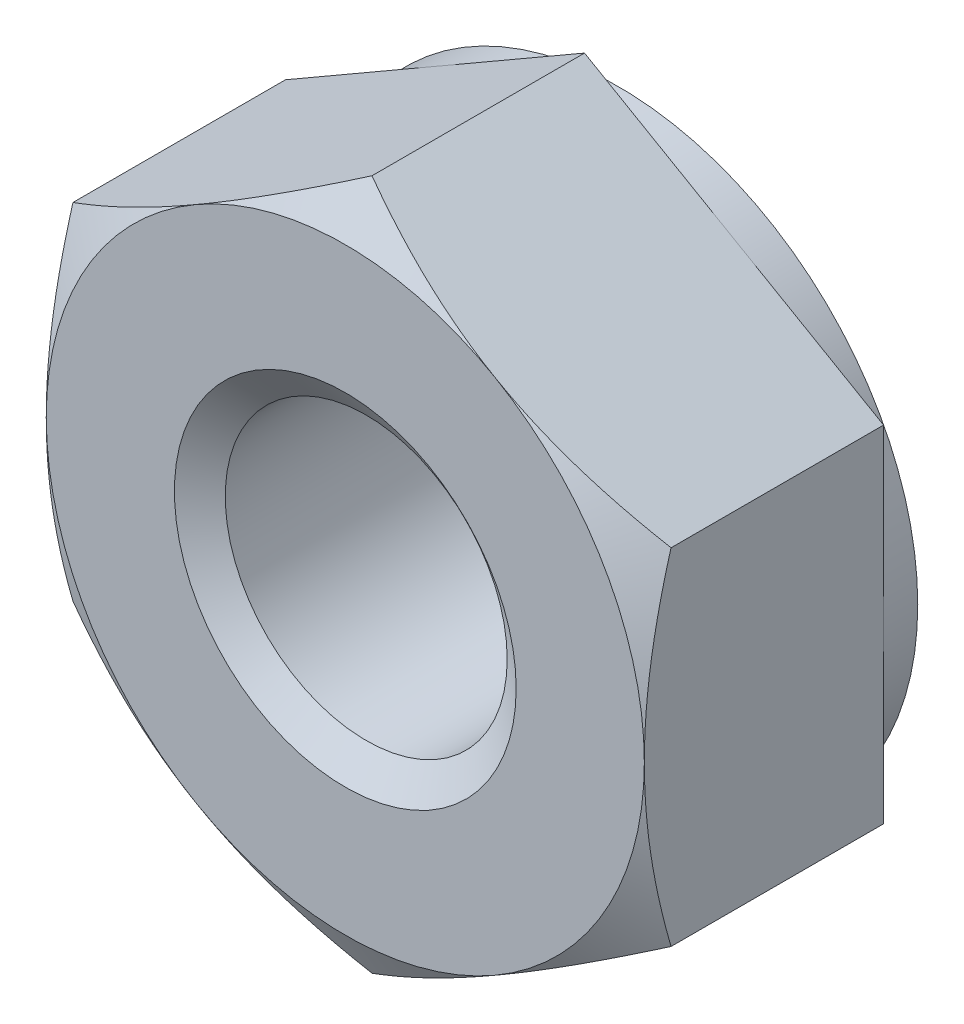
ISO-10303-21;
HEADER;
FILE_DESCRIPTION(('STEP AP214'),'2;1');
FILE_NAME('part.step','',(''),(''),'','','');
FILE_SCHEMA(('AUTOMOTIVE_DESIGN { 1 0 10303 214 1 1 1 1 }'));
ENDSEC;
DATA;
#1=APPLICATION_CONTEXT('core data for automotive mechanical design processes');
#2=APPLICATION_PROTOCOL_DEFINITION('international standard','automotive_design',2000,#1);
#3=PRODUCT_CONTEXT('',#1,'mechanical');
#4=PRODUCT('Part','Part','',(#3));
#5=PRODUCT_RELATED_PRODUCT_CATEGORY('part','',(#4));
#6=PRODUCT_DEFINITION_FORMATION('','',#4);
#7=PRODUCT_DEFINITION_CONTEXT('part definition',#1,'design');
#8=PRODUCT_DEFINITION('design','',#6,#7);
#9=PRODUCT_DEFINITION_SHAPE('','',#8);
#10=(LENGTH_UNIT() NAMED_UNIT(*) SI_UNIT(.MILLI.,.METRE.));
#11=(NAMED_UNIT(*) PLANE_ANGLE_UNIT() SI_UNIT($,.RADIAN.));
#12=(NAMED_UNIT(*) SI_UNIT($,.STERADIAN.) SOLID_ANGLE_UNIT());
#13=UNCERTAINTY_MEASURE_WITH_UNIT(LENGTH_MEASURE(1.E-05),#10,'distance_accuracy_value','');
#14=(GEOMETRIC_REPRESENTATION_CONTEXT(3) GLOBAL_UNCERTAINTY_ASSIGNED_CONTEXT((#13)) GLOBAL_UNIT_ASSIGNED_CONTEXT((#10,
#11,#12)) REPRESENTATION_CONTEXT('',''));
#15=CARTESIAN_POINT('',(0.,0.,0.));
#16=DIRECTION('',(0.,0.,1.));
#17=DIRECTION('',(1.,0.,0.));
#18=AXIS2_PLACEMENT_3D('',#15,#16,#17);
#19=CARTESIAN_POINT('',(0.,0.,-3.2));
#20=DIRECTION('',(0.,0.,1.));
#21=DIRECTION('',(1.,0.,0.));
#22=AXIS2_PLACEMENT_3D('',#19,#20,#21);
#23=CYLINDRICAL_SURFACE('',#22,1.65);
#24=CARTESIAN_POINT('',(0.,0.,-0.245072638373399));
#25=DIRECTION('',(0.,0.,1.));
#26=DIRECTION('',(1.,0.,0.));
#27=AXIS2_PLACEMENT_3D('',#24,#25,#26);
#28=CIRCLE('',#27,1.65);
#29=CARTESIAN_POINT('',(1.65,0.,-0.245072638373399));
#30=VERTEX_POINT('',#29);
#31=EDGE_CURVE('E154',#30,#30,#28,.F.);
#32=ORIENTED_EDGE('',*,*,#31,.F.);
#33=EDGE_LOOP('',(#32));
#34=FACE_BOUND('',#33,.T.);
#35=CARTESIAN_POINT('',(0.,0.,-2.9295273616266));
#36=DIRECTION('',(0.,0.,-1.));
#37=DIRECTION('',(-1.,0.,0.));
#38=AXIS2_PLACEMENT_3D('',#35,#36,#37);
#39=CIRCLE('',#38,1.65);
#40=CARTESIAN_POINT('',(-1.65,0.,-2.9295273616266));
#41=VERTEX_POINT('',#40);
#42=EDGE_CURVE('E42',#41,#41,#39,.F.);
#43=ORIENTED_EDGE('',*,*,#42,.F.);
#44=EDGE_LOOP('',(#43));
#45=FACE_BOUND('',#44,.T.);
#46=ADVANCED_FACE('F37',(#34,#45),#23,.F.);
#47=CARTESIAN_POINT('',(-6.99999999999999,0.,-3.2));
#48=DIRECTION('',(0.,0.,1.));
#49=DIRECTION('',(1.,0.,0.));
#50=AXIS2_PLACEMENT_3D('',#47,#48,#49);
#51=PLANE('',#50);
#52=CARTESIAN_POINT('',(0.,0.,-3.2));
#53=DIRECTION('',(0.,0.,1.));
#54=DIRECTION('',(1.,0.,0.));
#55=AXIS2_PLACEMENT_3D('',#52,#53,#54);
#56=CIRCLE('',#55,3.5);
#57=CARTESIAN_POINT('',(3.5,0.,-3.2));
#58=VERTEX_POINT('',#57);
#59=EDGE_CURVE('E278',#58,#58,#56,.F.);
#60=ORIENTED_EDGE('',*,*,#59,.T.);
#61=EDGE_LOOP('',(#60));
#62=FACE_BOUND('',#61,.T.);
#63=CARTESIAN_POINT('',(0.,0.,-3.2));
#64=DIRECTION('',(0.,0.,1.));
#65=DIRECTION('',(1.,0.,0.));
#66=AXIS2_PLACEMENT_3D('',#63,#64,#65);
#67=CIRCLE('',#66,2.);
#68=CARTESIAN_POINT('',(2.,0.,-3.2));
#69=VERTEX_POINT('',#68);
#70=EDGE_CURVE('E298',#69,#69,#67,.F.);
#71=ORIENTED_EDGE('',*,*,#70,.F.);
#72=EDGE_LOOP('',(#71));
#73=FACE_BOUND('',#72,.T.);
#74=ADVANCED_FACE('F230',(#62,#73),#51,.F.);
#75=CARTESIAN_POINT('',(-6.99999999999999,0.,0.));
#76=DIRECTION('',(0.,0.,1.));
#77=DIRECTION('',(1.,0.,0.));
#78=AXIS2_PLACEMENT_3D('',#75,#76,#77);
#79=PLANE('',#78);
#80=CARTESIAN_POINT('',(0.,0.,0.));
#81=DIRECTION('',(0.,0.,1.));
#82=DIRECTION('',(1.,0.,0.));
#83=AXIS2_PLACEMENT_3D('',#80,#81,#82);
#84=CIRCLE('',#83,3.5);
#85=CARTESIAN_POINT('',(3.5,0.,0.));
#86=VERTEX_POINT('',#85);
#87=CARTESIAN_POINT('',(1.75,-3.03108891324553,0.));
#88=VERTEX_POINT('',#87);
#89=EDGE_CURVE('E12',#86,#88,#84,.F.);
#90=ORIENTED_EDGE('',*,*,#89,.F.);
#91=CARTESIAN_POINT('',(0.,0.,0.));
#92=DIRECTION('',(0.,0.,1.));
#93=DIRECTION('',(1.,0.,0.));
#94=AXIS2_PLACEMENT_3D('',#91,#92,#93);
#95=CIRCLE('',#94,3.5);
#96=CARTESIAN_POINT('',(1.75,3.03108891324553,0.));
#97=VERTEX_POINT('',#96);
#98=EDGE_CURVE('E146',#86,#97,#95,.T.);
#99=ORIENTED_EDGE('',*,*,#98,.T.);
#100=CARTESIAN_POINT('',(-1.75,3.03108891324553,0.));
#101=VERTEX_POINT('',#100);
#102=EDGE_CURVE('E49',#101,#97,#84,.F.);
#103=ORIENTED_EDGE('',*,*,#102,.F.);
#104=CARTESIAN_POINT('',(-3.5,0.,0.));
#105=VERTEX_POINT('',#104);
#106=EDGE_CURVE('E359',#105,#101,#84,.F.);
#107=ORIENTED_EDGE('',*,*,#106,.F.);
#108=CARTESIAN_POINT('',(-1.75,-3.03108891324553,0.));
#109=VERTEX_POINT('',#108);
#110=EDGE_CURVE('E361',#109,#105,#84,.F.);
#111=ORIENTED_EDGE('',*,*,#110,.F.);
#112=EDGE_CURVE('E47',#88,#109,#84,.F.);
#113=ORIENTED_EDGE('',*,*,#112,.F.);
#114=EDGE_LOOP('',(#90,#99,#103,#107,#111,#113));
#115=FACE_BOUND('',#114,.T.);
#116=CARTESIAN_POINT('',(0.,0.,0.));
#117=DIRECTION('',(0.,0.,1.));
#118=DIRECTION('',(1.,0.,0.));
#119=AXIS2_PLACEMENT_3D('',#116,#117,#118);
#120=CIRCLE('',#119,2.);
#121=CARTESIAN_POINT('',(2.,0.,0.));
#122=VERTEX_POINT('',#121);
#123=EDGE_CURVE('E297',#122,#122,#120,.T.);
#124=ORIENTED_EDGE('',*,*,#123,.F.);
#125=EDGE_LOOP('',(#124));
#126=FACE_BOUND('',#125,.T.);
#127=ADVANCED_FACE('F156',(#115,#126),#79,.T.);
#128=CARTESIAN_POINT('',(0.,4.04145188432738,-3.2));
#129=DIRECTION('',(-0.500000000000001,0.866025403784438,0.));
#130=DIRECTION('',(-0.866025403784438,-0.500000000000001,0.));
#131=AXIS2_PLACEMENT_3D('',#128,#129,#130);
#132=PLANE('',#131);
#133=DIRECTION('',(0.,0.,1.));
#134=VECTOR('',#133,1.);
#135=CARTESIAN_POINT('',(-3.5,2.02072594216369,-3.2));
#136=LINE('',#135,#134);
#137=CARTESIAN_POINT('',(-3.5,2.02072594216369,-2.8));
#138=VERTEX_POINT('',#137);
#139=CARTESIAN_POINT('',(-3.5,2.02072594216369,-0.312607391169646));
#140=VERTEX_POINT('',#139);
#141=EDGE_CURVE('E287',#138,#140,#136,.T.);
#142=ORIENTED_EDGE('',*,*,#141,.T.);
#143=CARTESIAN_POINT('',(-3.5002,2.02061047210985,-0.312674060693371));
#144=CARTESIAN_POINT('',(-3.34639282154755,2.10941108799267,-0.261385788989983));
#145=CARTESIAN_POINT('',(-3.19125798916558,2.19897822522909,-0.214740953816197));
#146=CARTESIAN_POINT('',(-2.87830199342322,2.37966345361545,-0.133321875533348));
#147=CARTESIAN_POINT('',(-2.7204752692125,2.47078475532382,-0.0985764355845606));
#148=CARTESIAN_POINT('',(-2.40677778961987,2.65189807961073,-0.0444900271828352));
#149=CARTESIAN_POINT('',(-2.25095530083931,2.74186223545399,-0.0247890862603806));
#150=CARTESIAN_POINT('',(-1.93857711279463,2.92221386641055,-0.00127013273725352));
#151=CARTESIAN_POINT('',(-1.78202254896577,3.01260068598001,0.00256735545443549));
#152=CARTESIAN_POINT('',(-1.48949078007901,3.1814939814933,-0.00541530187697728));
#153=CARTESIAN_POINT('',(-1.35346978754209,3.26002573814993,-0.0152754340696069));
#154=CARTESIAN_POINT('',(-1.08231397971101,3.41657761679354,-0.0465264668994037));
#155=CARTESIAN_POINT('',(-0.947180102315318,3.49459719728458,-0.0679280432857986));
#156=CARTESIAN_POINT('',(-0.675465207594817,3.65147186489429,-0.121430407880578));
#157=CARTESIAN_POINT('',(-0.538918580721665,3.73030709667644,-0.153757994445088));
#158=CARTESIAN_POINT('',(-0.267861907055499,3.88680174018324,-0.227128933807996));
#159=CARTESIAN_POINT('',(-0.133348387531464,3.96446315689009,-0.268155046569869));
#160=CARTESIAN_POINT('',(0.000199999999999939,4.04156735438122,-0.312674060693373));
#161=B_SPLINE_CURVE_WITH_KNOTS('',3,(#143,#144,#145,#146,#147,#148,#149,#150,#151,#152,#153,
#154,#155,#156,#157,#158,#159,#160),.UNSPECIFIED.,.F.,.F.,(4,2,2,2,2,2,2,2,4),(0.,
0.554793832886254,1.11092123814984,1.65328467083219,2.19498204478403,2.6666513085086,
3.13875761298267,3.6213361260051,4.10296698719188),.UNSPECIFIED.);
#162=EDGE_CURVE('E140',#140,#101,#161,.T.);
#163=ORIENTED_EDGE('',*,*,#162,.T.);
#164=CARTESIAN_POINT('',(0.,4.04145188432738,-0.312607391169646));
#165=VERTEX_POINT('',#164);
#166=EDGE_CURVE('E168',#101,#165,#161,.T.);
#167=ORIENTED_EDGE('',*,*,#166,.T.);
#168=DIRECTION('',(0.,0.,1.));
#169=VECTOR('',#168,1.);
#170=CARTESIAN_POINT('',(0.,4.04145188432738,-3.2));
#171=LINE('',#170,#169);
#172=CARTESIAN_POINT('',(0.,4.04145188432738,-2.8));
#173=VERTEX_POINT('',#172);
#174=EDGE_CURVE('E275',#173,#165,#171,.T.);
#175=ORIENTED_EDGE('',*,*,#174,.F.);
#176=DIRECTION('',(-0.866025403784438,-0.500000000000001,0.));
#177=VECTOR('',#176,1.);
#178=CARTESIAN_POINT('',(0.,4.04145188432738,-2.8));
#179=LINE('',#178,#177);
#180=CARTESIAN_POINT('',(-1.75,3.03108891324553,-2.8));
#181=VERTEX_POINT('',#180);
#182=EDGE_CURVE('E263',#173,#181,#179,.T.);
#183=ORIENTED_EDGE('',*,*,#182,.T.);
#184=EDGE_CURVE('E259',#181,#138,#179,.T.);
#185=ORIENTED_EDGE('',*,*,#184,.T.);
#186=EDGE_LOOP('',(#142,#163,#167,#175,#183,#185));
#187=FACE_BOUND('',#186,.T.);
#188=ADVANCED_FACE('F39',(#187),#132,.T.);
#189=CARTESIAN_POINT('',(3.5,2.02072594216369,-3.2));
#190=DIRECTION('',(0.500000000000001,0.866025403784438,0.));
#191=DIRECTION('',(-0.866025403784438,0.500000000000001,0.));
#192=AXIS2_PLACEMENT_3D('',#189,#190,#191);
#193=PLANE('',#192);
#194=ORIENTED_EDGE('',*,*,#174,.T.);
#195=CARTESIAN_POINT('',(-0.000200000000000017,4.04156735438122,-0.312674060693373));
#196=CARTESIAN_POINT('',(0.15360717845245,3.9527667384984,-0.261385788989986));
#197=CARTESIAN_POINT('',(0.308742010834424,3.86319960126198,-0.214740953816199));
#198=CARTESIAN_POINT('',(0.621698006576782,3.68251437287562,-0.13332187553335));
#199=CARTESIAN_POINT('',(0.779524730787496,3.59139307116725,-0.0985764355845622));
#200=CARTESIAN_POINT('',(1.09322221038013,3.41027974688034,-0.0444900271828363));
#201=CARTESIAN_POINT('',(1.24904469916069,3.32031559103708,-0.0247890862603816));
#202=CARTESIAN_POINT('',(1.56142288720537,3.13996396008052,-0.00127013273725422));
#203=CARTESIAN_POINT('',(1.71797745103423,3.04957714051106,0.00256735545443501));
#204=CARTESIAN_POINT('',(2.01050921992099,2.88068384499777,-0.00541530187697733));
#205=CARTESIAN_POINT('',(2.14653021245791,2.80215208834114,-0.0152754340696067));
#206=CARTESIAN_POINT('',(2.417686020289,2.64560020969753,-0.0465264668994031));
#207=CARTESIAN_POINT('',(2.55281989768468,2.56758062920649,-0.0679280432857977));
#208=CARTESIAN_POINT('',(2.82453479240518,2.41070596159678,-0.121430407880577));
#209=CARTESIAN_POINT('',(2.96108141927834,2.33187072981463,-0.153757994445087));
#210=CARTESIAN_POINT('',(3.2321380929445,2.17537608630783,-0.227128933807994));
#211=CARTESIAN_POINT('',(3.36665161246854,2.09771466960098,-0.268155046569867));
#212=CARTESIAN_POINT('',(3.5002,2.02061047210985,-0.312674060693371));
#213=B_SPLINE_CURVE_WITH_KNOTS('',3,(#195,#196,#197,#198,#199,#200,#201,#202,#203,#204,#205,
#206,#207,#208,#209,#210,#211,#212),.UNSPECIFIED.,.F.,.F.,(4,2,2,2,2,2,2,2,4),(0.,
0.554793832886255,1.11092123814984,1.65328467083219,2.19498204478403,2.6666513085086,
3.13875761298267,3.6213361260051,4.10296698719187),.UNSPECIFIED.);
#214=EDGE_CURVE('E164',#165,#97,#213,.T.);
#215=ORIENTED_EDGE('',*,*,#214,.T.);
#216=CARTESIAN_POINT('',(3.5,2.0207259421637,-0.312607391169646));
#217=VERTEX_POINT('',#216);
#218=EDGE_CURVE('E149',#97,#217,#213,.T.);
#219=ORIENTED_EDGE('',*,*,#218,.T.);
#220=DIRECTION('',(0.,0.,1.));
#221=VECTOR('',#220,1.);
#222=CARTESIAN_POINT('',(3.5,2.02072594216369,-3.2));
#223=LINE('',#222,#221);
#224=CARTESIAN_POINT('',(3.5,2.02072594216369,-2.8));
#225=VERTEX_POINT('',#224);
#226=EDGE_CURVE('E163',#225,#217,#223,.T.);
#227=ORIENTED_EDGE('',*,*,#226,.F.);
#228=DIRECTION('',(-0.866025403784438,0.500000000000001,0.));
#229=VECTOR('',#228,1.);
#230=CARTESIAN_POINT('',(3.5,2.02072594216369,-2.8));
#231=LINE('',#230,#229);
#232=CARTESIAN_POINT('',(1.75,3.03108891324553,-2.8));
#233=VERTEX_POINT('',#232);
#234=EDGE_CURVE('E271',#225,#233,#231,.T.);
#235=ORIENTED_EDGE('',*,*,#234,.T.);
#236=EDGE_CURVE('E267',#233,#173,#231,.T.);
#237=ORIENTED_EDGE('',*,*,#236,.T.);
#238=EDGE_LOOP('',(#194,#215,#219,#227,#235,#237));
#239=FACE_BOUND('',#238,.T.);
#240=ADVANCED_FACE('F243',(#239),#193,.T.);
#241=CARTESIAN_POINT('',(3.5,2.02072594216369,-3.2));
#242=DIRECTION('',(-1.,0.,0.));
#243=DIRECTION('',(0.,0.,1.));
#244=AXIS2_PLACEMENT_3D('',#241,#242,#243);
#245=PLANE('',#244);
#246=CARTESIAN_POINT('',(3.5,-5.35926299121406,-1.67484346858556));
#247=CARTESIAN_POINT('',(3.5,-5.20559319908842,-1.60058173692104));
#248=CARTESIAN_POINT('',(3.5,-5.05156008083376,-1.52705822833148));
#249=CARTESIAN_POINT('',(3.5,-4.74257074180711,-1.38190950344752));
#250=CARTESIAN_POINT('',(3.5,-4.58761436682437,-1.31028461582133));
#251=CARTESIAN_POINT('',(3.5,-4.27574500225542,-1.16897765517624));
#252=CARTESIAN_POINT('',(3.5,-4.11882589028192,-1.09930904568016));
#253=CARTESIAN_POINT('',(3.5,-3.80369792903856,-0.962964262242762));
#254=CARTESIAN_POINT('',(3.5,-3.64548914750596,-0.89628793231952));
#255=CARTESIAN_POINT('',(3.5,-3.32556618401855,-0.765931819095069));
#256=CARTESIAN_POINT('',(3.5,-3.16383281219924,-0.702298873688866));
#257=CARTESIAN_POINT('',(3.5,-2.83845840945598,-0.580016702089494));
#258=CARTESIAN_POINT('',(3.5,-2.67481716858826,-0.521368030370692));
#259=CARTESIAN_POINT('',(3.5,-2.34570278472049,-0.410630279877022));
#260=CARTESIAN_POINT('',(3.5,-2.18023438248743,-0.358527255435859));
#261=CARTESIAN_POINT('',(3.5,-1.8469452280637,-0.262572936976444));
#262=CARTESIAN_POINT('',(3.5,-1.6791252378753,-0.218719033467159));
#263=CARTESIAN_POINT('',(3.5,-1.34101828610925,-0.141391945584787));
#264=CARTESIAN_POINT('',(3.5,-1.17073068027694,-0.107921525211973));
#265=CARTESIAN_POINT('',(3.5,-0.828102385138486,-0.0536149564320506));
#266=CARTESIAN_POINT('',(3.5,-0.655761694017304,-0.0327788191952365));
#267=CARTESIAN_POINT('',(3.5,-0.311020490924451,-0.00558408650575658));
#268=CARTESIAN_POINT('',(3.5,-0.138627397207261,0.000866163165911265));
#269=CARTESIAN_POINT('',(3.5,0.206038074906534,-0.0010535580779461));
#270=CARTESIAN_POINT('',(3.5,0.378310473023179,-0.00941968196343176));
#271=CARTESIAN_POINT('',(3.5,0.672490555822326,-0.0357688927868919));
#272=CARTESIAN_POINT('',(3.5,0.794722791084091,-0.0503206340384212));
#273=CARTESIAN_POINT('',(3.5,1.0382430543056,-0.0859367340533556));
#274=CARTESIAN_POINT('',(3.5,1.15953093025887,-0.107002119926141));
#275=CARTESIAN_POINT('',(3.5,1.52187914771348,-0.178863187081452));
#276=CARTESIAN_POINT('',(3.5,1.76124104212632,-0.238305275622009));
#277=CARTESIAN_POINT('',(3.5,2.11940971387708,-0.340826814402554));
#278=CARTESIAN_POINT('',(3.5,2.24008344316346,-0.377749699085182));
#279=CARTESIAN_POINT('',(3.5,2.48017139213728,-0.455249007699293));
#280=CARTESIAN_POINT('',(3.5,2.59958641795613,-0.495822911663549));
#281=CARTESIAN_POINT('',(3.5,2.83665760451798,-0.579779986782752));
#282=CARTESIAN_POINT('',(3.5,2.95431988203483,-0.623146060034314));
#283=CARTESIAN_POINT('',(3.5,3.188731535088,-0.712423559566865));
#284=CARTESIAN_POINT('',(3.5,3.30548051959464,-0.758336014592949));
#285=CARTESIAN_POINT('',(3.5,3.42180736613348,-0.805270380724069));
#286=B_SPLINE_CURVE_WITH_KNOTS('',3,(#246,#247,#248,#249,#250,#251,#252,#253,#254,#255,#256,
#257,#258,#259,#260,#261,#262,#263,#264,#265,#266,#267,#268,#269,#270,#271,#272,#273,#274,#275,
#276,#277,#278,#279,#280,#281,#282,#283,#284,#285),.UNSPECIFIED.,.F.,.F.,(4,2,2,2,2,2,2,2,2,2,2,
2,2,2,2,2,2,2,2,4),(0.,0.512025318465738,1.02413870177436,1.53918270315241,2.05419982499224,
2.57553975872798,3.09693761309353,3.61720506610401,4.13730766217537,4.65754858684365,
5.17778997146961,5.69470725122282,6.21149033452401,6.58059623222331,6.94976036239485,
7.68863804939851,8.06719621660478,8.44549507476761,8.82166461280099,9.1979872473341),.UNSPECIFIED.);
#287=CARTESIAN_POINT('',(3.5,-2.02072594216369,-0.312607391169646));
#288=VERTEX_POINT('',#287);
#289=EDGE_CURVE('E129',#288,#86,#286,.T.);
#290=ORIENTED_EDGE('',*,*,#289,.F.);
#291=DIRECTION('',(0.,0.,1.));
#292=VECTOR('',#291,1.);
#293=CARTESIAN_POINT('',(3.5,-2.0207259421637,-3.2));
#294=LINE('',#293,#292);
#295=CARTESIAN_POINT('',(3.5,-2.0207259421637,-2.8));
#296=VERTEX_POINT('',#295);
#297=EDGE_CURVE('E280',#296,#288,#294,.T.);
#298=ORIENTED_EDGE('',*,*,#297,.F.);
#299=DIRECTION('',(0.,-1.,0.));
#300=VECTOR('',#299,1.);
#301=CARTESIAN_POINT('',(3.5,2.02072594216369,-2.8));
#302=LINE('',#301,#300);
#303=CARTESIAN_POINT('',(3.5,0.,-2.8));
#304=VERTEX_POINT('',#303);
#305=EDGE_CURVE('E272',#304,#296,#302,.T.);
#306=ORIENTED_EDGE('',*,*,#305,.F.);
#307=EDGE_CURVE('E274',#225,#304,#302,.T.);
#308=ORIENTED_EDGE('',*,*,#307,.F.);
#309=ORIENTED_EDGE('',*,*,#226,.T.);
#310=EDGE_CURVE('E142',#86,#217,#286,.T.);
#311=ORIENTED_EDGE('',*,*,#310,.F.);
#312=EDGE_LOOP('',(#290,#298,#306,#308,#309,#311));
#313=FACE_BOUND('',#312,.T.);
#314=ADVANCED_FACE('F160',(#313),#245,.F.);
#315=CARTESIAN_POINT('',(0.,-4.04145188432739,-3.2));
#316=DIRECTION('',(0.500000000000001,-0.866025403784438,0.));
#317=DIRECTION('',(0.866025403784438,0.500000000000001,0.));
#318=AXIS2_PLACEMENT_3D('',#315,#316,#317);
#319=PLANE('',#318);
#320=ORIENTED_EDGE('',*,*,#297,.T.);
#321=CARTESIAN_POINT('',(3.5002,-2.02061047210986,-0.312674060693373));
#322=CARTESIAN_POINT('',(3.34639282154755,-2.10941108799268,-0.261385788989986));
#323=CARTESIAN_POINT('',(3.19125798916558,-2.1989782252291,-0.214740953816199));
#324=CARTESIAN_POINT('',(2.87830199342322,-2.37966345361546,-0.133321875533351));
#325=CARTESIAN_POINT('',(2.7204752692125,-2.47078475532383,-0.0985764355845637));
#326=CARTESIAN_POINT('',(2.40677778961987,-2.65189807961074,-0.0444900271828386));
#327=CARTESIAN_POINT('',(2.25095530083931,-2.741862235454,-0.0247890862603844));
#328=CARTESIAN_POINT('',(1.93857711279463,-2.92221386641056,-0.00127013273725773));
#329=CARTESIAN_POINT('',(1.78202254896577,-3.01260068598002,0.00256735545443119));
#330=CARTESIAN_POINT('',(1.48949078007901,-3.18149398149331,-0.00541530187698195));
#331=CARTESIAN_POINT('',(1.35346978754209,-3.26002573814994,-0.0152754340696118));
#332=CARTESIAN_POINT('',(1.082313979711,-3.41657761679355,-0.0465264668994089));
#333=CARTESIAN_POINT('',(0.947180102315317,-3.49459719728459,-0.0679280432858037));
#334=CARTESIAN_POINT('',(0.675465207594816,-3.6514718648943,-0.121430407880583));
#335=CARTESIAN_POINT('',(0.538918580721664,-3.73030709667645,-0.153757994445093));
#336=CARTESIAN_POINT('',(0.267861907055498,-3.88680174018325,-0.227128933808001));
#337=CARTESIAN_POINT('',(0.133348387531464,-3.9644631568901,-0.268155046569874));
#338=CARTESIAN_POINT('',(-0.000199999999999601,-4.04156735438123,-0.312674060693378));
#339=B_SPLINE_CURVE_WITH_KNOTS('',3,(#321,#322,#323,#324,#325,#326,#327,#328,#329,#330,#331,
#332,#333,#334,#335,#336,#337,#338),.UNSPECIFIED.,.F.,.F.,(4,2,2,2,2,2,2,2,4),(0.,
0.554793832886254,1.11092123814984,1.65328467083219,2.19498204478403,2.6666513085086,
3.13875761298268,3.6213361260051,4.10296698719188),.UNSPECIFIED.);
#340=EDGE_CURVE('E135',#288,#88,#339,.T.);
#341=ORIENTED_EDGE('',*,*,#340,.T.);
#342=CARTESIAN_POINT('',(0.,-4.04145188432738,-0.312607391169646));
#343=VERTEX_POINT('',#342);
#344=EDGE_CURVE('E56',#88,#343,#339,.T.);
#345=ORIENTED_EDGE('',*,*,#344,.T.);
#346=DIRECTION('',(0.,0.,1.));
#347=VECTOR('',#346,1.);
#348=CARTESIAN_POINT('',(0.,-4.04145188432739,-3.2));
#349=LINE('',#348,#347);
#350=CARTESIAN_POINT('',(0.,-4.04145188432739,-2.8));
#351=VERTEX_POINT('',#350);
#352=EDGE_CURVE('E282',#351,#343,#349,.T.);
#353=ORIENTED_EDGE('',*,*,#352,.F.);
#354=DIRECTION('',(0.866025403784438,0.500000000000001,0.));
#355=VECTOR('',#354,1.);
#356=CARTESIAN_POINT('',(0.,-4.04145188432739,-2.8));
#357=LINE('',#356,#355);
#358=CARTESIAN_POINT('',(1.75000000000001,-3.03108891324554,-2.8));
#359=VERTEX_POINT('',#358);
#360=EDGE_CURVE('E264',#351,#359,#357,.T.);
#361=ORIENTED_EDGE('',*,*,#360,.T.);
#362=EDGE_CURVE('E268',#359,#296,#357,.T.);
#363=ORIENTED_EDGE('',*,*,#362,.T.);
#364=EDGE_LOOP('',(#320,#341,#345,#353,#361,#363));
#365=FACE_BOUND('',#364,.T.);
#366=ADVANCED_FACE('F216',(#365),#319,.T.);
#367=CARTESIAN_POINT('',(-3.5,-2.0207259421637,-3.2));
#368=DIRECTION('',(-0.500000000000001,-0.866025403784438,0.));
#369=DIRECTION('',(0.866025403784438,-0.500000000000001,0.));
#370=AXIS2_PLACEMENT_3D('',#367,#368,#369);
#371=PLANE('',#370);
#372=ORIENTED_EDGE('',*,*,#352,.T.);
#373=CARTESIAN_POINT('',(0.000200000000000125,-4.04156735438123,-0.312674060693379));
#374=CARTESIAN_POINT('',(-0.15360717845245,-3.95276673849841,-0.261385788989991));
#375=CARTESIAN_POINT('',(-0.308742010834425,-3.86319960126199,-0.214740953816204));
#376=CARTESIAN_POINT('',(-0.621698006576783,-3.68251437287563,-0.133321875533355));
#377=CARTESIAN_POINT('',(-0.779524730787498,-3.59139307116726,-0.098576435584567));
#378=CARTESIAN_POINT('',(-1.09322221038013,-3.41027974688034,-0.0444900271828409));
#379=CARTESIAN_POINT('',(-1.2490446991607,-3.32031559103709,-0.024789086260386));
#380=CARTESIAN_POINT('',(-1.56142288720538,-3.13996396008052,-0.00127013273725835));
#381=CARTESIAN_POINT('',(-1.71797745103424,-3.04957714051107,0.00256735545443095));
#382=CARTESIAN_POINT('',(-2.01050921992099,-2.88068384499778,-0.00541530187698138));
#383=CARTESIAN_POINT('',(-2.14653021245791,-2.80215208834115,-0.0152754340696108));
#384=CARTESIAN_POINT('',(-2.417686020289,-2.64560020969754,-0.0465264668994071));
#385=CARTESIAN_POINT('',(-2.55281989768469,-2.5675806292065,-0.0679280432858017));
#386=CARTESIAN_POINT('',(-2.82453479240519,-2.41070596159679,-0.12143040788058));
#387=CARTESIAN_POINT('',(-2.96108141927834,-2.33187072981464,-0.15375799444509));
#388=CARTESIAN_POINT('',(-3.2321380929445,-2.17537608630783,-0.227128933807997));
#389=CARTESIAN_POINT('',(-3.36665161246854,-2.09771466960099,-0.268155046569869));
#390=CARTESIAN_POINT('',(-3.5002,-2.02061047210986,-0.312674060693373));
#391=B_SPLINE_CURVE_WITH_KNOTS('',3,(#373,#374,#375,#376,#377,#378,#379,#380,#381,#382,#383,
#384,#385,#386,#387,#388,#389,#390),.UNSPECIFIED.,.F.,.F.,(4,2,2,2,2,2,2,2,4),(0.,
0.554793832886256,1.11092123814984,1.65328467083219,2.19498204478404,2.66665130850861,
3.13875761298268,3.6213361260051,4.10296698719187),.UNSPECIFIED.);
#392=EDGE_CURVE('E210',#343,#109,#391,.T.);
#393=ORIENTED_EDGE('',*,*,#392,.T.);
#394=CARTESIAN_POINT('',(-3.5,-2.0207259421637,-0.312607391169646));
#395=VERTEX_POINT('',#394);
#396=EDGE_CURVE('E63',#109,#395,#391,.T.);
#397=ORIENTED_EDGE('',*,*,#396,.T.);
#398=DIRECTION('',(0.,0.,1.));
#399=VECTOR('',#398,1.);
#400=CARTESIAN_POINT('',(-3.5,-2.0207259421637,-3.2));
#401=LINE('',#400,#399);
#402=CARTESIAN_POINT('',(-3.5,-2.0207259421637,-2.8));
#403=VERTEX_POINT('',#402);
#404=EDGE_CURVE('E285',#403,#395,#401,.T.);
#405=ORIENTED_EDGE('',*,*,#404,.F.);
#406=DIRECTION('',(0.866025403784438,-0.500000000000001,0.));
#407=VECTOR('',#406,1.);
#408=CARTESIAN_POINT('',(-3.5,-2.0207259421637,-2.8));
#409=LINE('',#408,#407);
#410=CARTESIAN_POINT('',(-1.75000000000001,-3.03108891324554,-2.8));
#411=VERTEX_POINT('',#410);
#412=EDGE_CURVE('E254',#403,#411,#409,.T.);
#413=ORIENTED_EDGE('',*,*,#412,.T.);
#414=EDGE_CURVE('E260',#411,#351,#409,.T.);
#415=ORIENTED_EDGE('',*,*,#414,.T.);
#416=EDGE_LOOP('',(#372,#393,#397,#405,#413,#415));
#417=FACE_BOUND('',#416,.T.);
#418=ADVANCED_FACE('F212',(#417),#371,.T.);
#419=CARTESIAN_POINT('',(-3.5,2.02072594216369,-3.2));
#420=DIRECTION('',(-1.,0.,0.));
#421=DIRECTION('',(0.,0.,1.));
#422=AXIS2_PLACEMENT_3D('',#419,#420,#421);
#423=PLANE('',#422);
#424=ORIENTED_EDGE('',*,*,#404,.T.);
#425=CARTESIAN_POINT('',(-3.5,-5.35926299121406,-1.67484346858556));
#426=CARTESIAN_POINT('',(-3.5,-5.20559319908842,-1.60058173692104));
#427=CARTESIAN_POINT('',(-3.5,-5.05156008083376,-1.52705822833148));
#428=CARTESIAN_POINT('',(-3.5,-4.74257074180711,-1.38190950344752));
#429=CARTESIAN_POINT('',(-3.5,-4.58761436682437,-1.31028461582133));
#430=CARTESIAN_POINT('',(-3.5,-4.27574500225542,-1.16897765517624));
#431=CARTESIAN_POINT('',(-3.5,-4.11882589028192,-1.09930904568016));
#432=CARTESIAN_POINT('',(-3.5,-3.80369792903856,-0.962964262242762));
#433=CARTESIAN_POINT('',(-3.5,-3.64548914750595,-0.89628793231952));
#434=CARTESIAN_POINT('',(-3.5,-3.32556618401855,-0.765931819095069));
#435=CARTESIAN_POINT('',(-3.5,-3.16383281219924,-0.702298873688866));
#436=CARTESIAN_POINT('',(-3.5,-2.83845840945598,-0.580016702089494));
#437=CARTESIAN_POINT('',(-3.5,-2.67481716858826,-0.521368030370692));
#438=CARTESIAN_POINT('',(-3.5,-2.34570278472049,-0.410630279877022));
#439=CARTESIAN_POINT('',(-3.5,-2.18023438248743,-0.358527255435859));
#440=CARTESIAN_POINT('',(-3.5,-1.8469452280637,-0.262572936976444));
#441=CARTESIAN_POINT('',(-3.5,-1.6791252378753,-0.218719033467159));
#442=CARTESIAN_POINT('',(-3.5,-1.34101828610925,-0.141391945584787));
#443=CARTESIAN_POINT('',(-3.5,-1.17073068027694,-0.107921525211973));
#444=CARTESIAN_POINT('',(-3.5,-0.828102385138486,-0.0536149564320507));
#445=CARTESIAN_POINT('',(-3.5,-0.655761694017304,-0.0327788191952368));
#446=CARTESIAN_POINT('',(-3.5,-0.311020490924452,-0.00558408650575683));
#447=CARTESIAN_POINT('',(-3.5,-0.138627397207262,0.000866163165911202));
#448=CARTESIAN_POINT('',(-3.5,0.206038074906533,-0.00105355807794604));
#449=CARTESIAN_POINT('',(-3.5,0.378310473023178,-0.00941968196343177));
#450=CARTESIAN_POINT('',(-3.5,0.672490555822326,-0.0357688927868918));
#451=CARTESIAN_POINT('',(-3.5,0.79472279108409,-0.050320634038421));
#452=CARTESIAN_POINT('',(-3.5,1.0382430543056,-0.0859367340533553));
#453=CARTESIAN_POINT('',(-3.5,1.15953093025886,-0.10700211992614));
#454=CARTESIAN_POINT('',(-3.5,1.52187914771348,-0.178863187081452));
#455=CARTESIAN_POINT('',(-3.5,1.76124104212632,-0.238305275622009));
#456=CARTESIAN_POINT('',(-3.5,2.11940971387708,-0.340826814402553));
#457=CARTESIAN_POINT('',(-3.5,2.24008344316346,-0.377749699085182));
#458=CARTESIAN_POINT('',(-3.5,2.48017139213728,-0.455249007699292));
#459=CARTESIAN_POINT('',(-3.5,2.59958641795613,-0.495822911663549));
#460=CARTESIAN_POINT('',(-3.5,2.83665760451798,-0.579779986782751));
#461=CARTESIAN_POINT('',(-3.5,2.95431988203483,-0.623146060034313));
#462=CARTESIAN_POINT('',(-3.5,3.188731535088,-0.712423559566865));
#463=CARTESIAN_POINT('',(-3.5,3.30548051959464,-0.758336014592948));
#464=CARTESIAN_POINT('',(-3.5,3.42180736613348,-0.805270380724069));
#465=B_SPLINE_CURVE_WITH_KNOTS('',3,(#425,#426,#427,#428,#429,#430,#431,#432,#433,#434,#435,
#436,#437,#438,#439,#440,#441,#442,#443,#444,#445,#446,#447,#448,#449,#450,#451,#452,#453,#454,
#455,#456,#457,#458,#459,#460,#461,#462,#463,#464),.UNSPECIFIED.,.F.,.F.,(4,2,2,2,2,2,2,2,2,2,2,
2,2,2,2,2,2,2,2,4),(0.,0.512025318465738,1.02413870177436,1.53918270315241,2.05419982499224,
2.57553975872798,3.09693761309353,3.61720506610401,4.13730766217537,4.65754858684365,
5.17778997146961,5.69470725122282,6.21149033452401,6.58059623222331,6.94976036239485,
7.68863804939851,8.06719621660478,8.44549507476761,8.82166461280099,9.1979872473341),.UNSPECIFIED.);
#466=EDGE_CURVE('E211',#395,#105,#465,.T.);
#467=ORIENTED_EDGE('',*,*,#466,.T.);
#468=EDGE_CURVE('E153',#105,#140,#465,.T.);
#469=ORIENTED_EDGE('',*,*,#468,.T.);
#470=ORIENTED_EDGE('',*,*,#141,.F.);
#471=DIRECTION('',(0.,-1.,0.));
#472=VECTOR('',#471,1.);
#473=CARTESIAN_POINT('',(-3.5,2.02072594216369,-2.8));
#474=LINE('',#473,#472);
#475=CARTESIAN_POINT('',(-3.5,0.,-2.8));
#476=VERTEX_POINT('',#475);
#477=EDGE_CURVE('E294',#138,#476,#474,.T.);
#478=ORIENTED_EDGE('',*,*,#477,.T.);
#479=EDGE_CURVE('E292',#476,#403,#474,.T.);
#480=ORIENTED_EDGE('',*,*,#479,.T.);
#481=EDGE_LOOP('',(#424,#467,#469,#470,#478,#480));
#482=FACE_BOUND('',#481,.T.);
#483=ADVANCED_FACE('F215',(#482),#423,.T.);
#484=CARTESIAN_POINT('',(0.,14.0414518843274,-2.8));
#485=DIRECTION('',(0.,0.,-1.));
#486=DIRECTION('',(-1.,0.,0.));
#487=AXIS2_PLACEMENT_3D('',#484,#485,#486);
#488=PLANE('',#487);
#489=ORIENTED_EDGE('',*,*,#307,.T.);
#490=CARTESIAN_POINT('',(0.,0.,-2.8));
#491=DIRECTION('',(0.,0.,1.));
#492=DIRECTION('',(1.,0.,0.));
#493=AXIS2_PLACEMENT_3D('',#490,#491,#492);
#494=CIRCLE('',#493,3.5);
#495=EDGE_CURVE('E251',#304,#233,#494,.T.);
#496=ORIENTED_EDGE('',*,*,#495,.T.);
#497=ORIENTED_EDGE('',*,*,#234,.F.);
#498=EDGE_LOOP('',(#489,#496,#497));
#499=FACE_BOUND('',#498,.T.);
#500=ADVANCED_FACE('F221',(#499),#488,.T.);
#501=ORIENTED_EDGE('',*,*,#305,.T.);
#502=ORIENTED_EDGE('',*,*,#362,.F.);
#503=EDGE_CURVE('E256',#359,#304,#494,.T.);
#504=ORIENTED_EDGE('',*,*,#503,.T.);
#505=EDGE_LOOP('',(#501,#502,#504));
#506=FACE_BOUND('',#505,.T.);
#507=ADVANCED_FACE('F226',(#506),#488,.T.);
#508=EDGE_CURVE('E255',#233,#181,#494,.T.);
#509=ORIENTED_EDGE('',*,*,#508,.T.);
#510=ORIENTED_EDGE('',*,*,#182,.F.);
#511=ORIENTED_EDGE('',*,*,#236,.F.);
#512=EDGE_LOOP('',(#509,#510,#511));
#513=FACE_BOUND('',#512,.T.);
#514=ADVANCED_FACE('F345',(#513),#488,.T.);
#515=ORIENTED_EDGE('',*,*,#414,.F.);
#516=EDGE_CURVE('E376',#411,#359,#494,.T.);
#517=ORIENTED_EDGE('',*,*,#516,.T.);
#518=ORIENTED_EDGE('',*,*,#360,.F.);
#519=EDGE_LOOP('',(#515,#517,#518));
#520=FACE_BOUND('',#519,.T.);
#521=ADVANCED_FACE('F340',(#520),#488,.T.);
#522=EDGE_CURVE('E349',#181,#476,#494,.T.);
#523=ORIENTED_EDGE('',*,*,#522,.T.);
#524=ORIENTED_EDGE('',*,*,#477,.F.);
#525=ORIENTED_EDGE('',*,*,#184,.F.);
#526=EDGE_LOOP('',(#523,#524,#525));
#527=FACE_BOUND('',#526,.T.);
#528=ADVANCED_FACE('F334',(#527),#488,.T.);
#529=CARTESIAN_POINT('',(0.,0.,0.));
#530=DIRECTION('',(0.,0.,1.));
#531=DIRECTION('',(1.,0.,0.));
#532=AXIS2_PLACEMENT_3D('',#529,#530,#531);
#533=CYLINDRICAL_SURFACE('',#532,3.5);
#534=ORIENTED_EDGE('',*,*,#59,.F.);
#535=EDGE_LOOP('',(#534));
#536=FACE_BOUND('',#535,.T.);
#537=ORIENTED_EDGE('',*,*,#508,.F.);
#538=ORIENTED_EDGE('',*,*,#495,.F.);
#539=ORIENTED_EDGE('',*,*,#503,.F.);
#540=ORIENTED_EDGE('',*,*,#516,.F.);
#541=EDGE_CURVE('E355',#476,#411,#494,.T.);
#542=ORIENTED_EDGE('',*,*,#541,.F.);
#543=ORIENTED_EDGE('',*,*,#522,.F.);
#544=EDGE_LOOP('',(#537,#538,#539,#540,#542,#543));
#545=FACE_BOUND('',#544,.T.);
#546=ADVANCED_FACE('F240',(#536,#545),#533,.T.);
#547=ORIENTED_EDGE('',*,*,#479,.F.);
#548=ORIENTED_EDGE('',*,*,#541,.T.);
#549=ORIENTED_EDGE('',*,*,#412,.F.);
#550=EDGE_LOOP('',(#547,#548,#549));
#551=FACE_BOUND('',#550,.T.);
#552=ADVANCED_FACE('F195',(#551),#488,.T.);
#553=CARTESIAN_POINT('',(0.,0.,0.));
#554=DIRECTION('',(0.,0.,-1.));
#555=DIRECTION('',(-1.,0.,0.));
#556=AXIS2_PLACEMENT_3D('',#553,#554,#555);
#557=CONICAL_SURFACE('',#556,3.5,1.0471975511966);
#558=ORIENTED_EDGE('',*,*,#98,.F.);
#559=ORIENTED_EDGE('',*,*,#310,.T.);
#560=ORIENTED_EDGE('',*,*,#218,.F.);
#561=EDGE_LOOP('',(#558,#559,#560));
#562=FACE_BOUND('',#561,.T.);
#563=ADVANCED_FACE('F147',(#562),#557,.T.);
#564=ORIENTED_EDGE('',*,*,#102,.T.);
#565=ORIENTED_EDGE('',*,*,#214,.F.);
#566=ORIENTED_EDGE('',*,*,#166,.F.);
#567=EDGE_LOOP('',(#564,#565,#566));
#568=FACE_BOUND('',#567,.T.);
#569=ADVANCED_FACE('F192',(#568),#557,.T.);
#570=ORIENTED_EDGE('',*,*,#468,.F.);
#571=ORIENTED_EDGE('',*,*,#106,.T.);
#572=ORIENTED_EDGE('',*,*,#162,.F.);
#573=EDGE_LOOP('',(#570,#571,#572));
#574=FACE_BOUND('',#573,.T.);
#575=ADVANCED_FACE('F191',(#574),#557,.T.);
#576=ORIENTED_EDGE('',*,*,#110,.T.);
#577=ORIENTED_EDGE('',*,*,#466,.F.);
#578=ORIENTED_EDGE('',*,*,#396,.F.);
#579=EDGE_LOOP('',(#576,#577,#578));
#580=FACE_BOUND('',#579,.T.);
#581=ADVANCED_FACE('F185',(#580),#557,.T.);
#582=ORIENTED_EDGE('',*,*,#112,.T.);
#583=ORIENTED_EDGE('',*,*,#392,.F.);
#584=ORIENTED_EDGE('',*,*,#344,.F.);
#585=EDGE_LOOP('',(#582,#583,#584));
#586=FACE_BOUND('',#585,.T.);
#587=ADVANCED_FACE('F190',(#586),#557,.T.);
#588=ORIENTED_EDGE('',*,*,#289,.T.);
#589=ORIENTED_EDGE('',*,*,#89,.T.);
#590=ORIENTED_EDGE('',*,*,#340,.F.);
#591=EDGE_LOOP('',(#588,#589,#590));
#592=FACE_BOUND('',#591,.T.);
#593=ADVANCED_FACE('F131',(#592),#557,.T.);
#594=CARTESIAN_POINT('',(0.,0.,-0.269579902210739));
#595=DIRECTION('',(0.,0.,1.));
#596=DIRECTION('',(1.,0.,0.));
#597=AXIS2_PLACEMENT_3D('',#594,#595,#596);
#598=CONICAL_SURFACE('',#597,1.615,0.95993108859688);
#599=ORIENTED_EDGE('',*,*,#123,.T.);
#600=EDGE_LOOP('',(#599));
#601=FACE_BOUND('',#600,.T.);
#602=ORIENTED_EDGE('',*,*,#31,.T.);
#603=EDGE_LOOP('',(#602));
#604=FACE_BOUND('',#603,.T.);
#605=ADVANCED_FACE('F193',(#601,#604),#598,.F.);
#606=CARTESIAN_POINT('',(0.,0.,-3.1746));
#607=DIRECTION('',(0.,0.,-1.));
#608=DIRECTION('',(-1.,0.,0.));
#609=AXIS2_PLACEMENT_3D('',#606,#607,#608);
#610=CONICAL_SURFACE('',#609,2.,0.959931088596881);
#611=CARTESIAN_POINT('',(0.,0.,-3.1746));
#612=DIRECTION('',(0.,0.,1.));
#613=DIRECTION('',(1.,0.,0.));
#614=AXIS2_PLACEMENT_3D('',#611,#612,#613);
#615=CIRCLE('',#614,2.);
#616=CARTESIAN_POINT('',(2.,0.,-3.1746));
#617=VERTEX_POINT('',#616);
#618=EDGE_CURVE('E300',#617,#617,#615,.T.);
#619=ORIENTED_EDGE('',*,*,#618,.F.);
#620=EDGE_LOOP('',(#619));
#621=FACE_BOUND('',#620,.T.);
#622=ORIENTED_EDGE('',*,*,#42,.T.);
#623=EDGE_LOOP('',(#622));
#624=FACE_BOUND('',#623,.T.);
#625=ADVANCED_FACE('F314',(#621,#624),#610,.F.);
#626=CARTESIAN_POINT('',(0.,0.,-25.0375057290932));
#627=DIRECTION('',(0.,0.,1.));
#628=DIRECTION('',(1.,0.,0.));
#629=AXIS2_PLACEMENT_3D('',#626,#627,#628);
#630=CYLINDRICAL_SURFACE('',#629,2.);
#631=ORIENTED_EDGE('',*,*,#618,.T.);
#632=EDGE_LOOP('',(#631));
#633=FACE_BOUND('',#632,.T.);
#634=ORIENTED_EDGE('',*,*,#70,.T.);
#635=EDGE_LOOP('',(#634));
#636=FACE_BOUND('',#635,.T.);
#637=ADVANCED_FACE('F319',(#633,#636),#630,.F.);
#638=CLOSED_SHELL('',(#46,#74,#127,#188,#240,#314,#366,#418,#483,#500,#507,#514,#521,#528,#546,
#552,#563,#569,#575,#581,#587,#593,#605,#625,#637));
#639=MANIFOLD_SOLID_BREP('B2',#638);
#640=ADVANCED_BREP_SHAPE_REPRESENTATION('',(#18,#639),#14);
#641=SHAPE_DEFINITION_REPRESENTATION(#9,#640);
ENDSEC;
END-ISO-10303-21;
